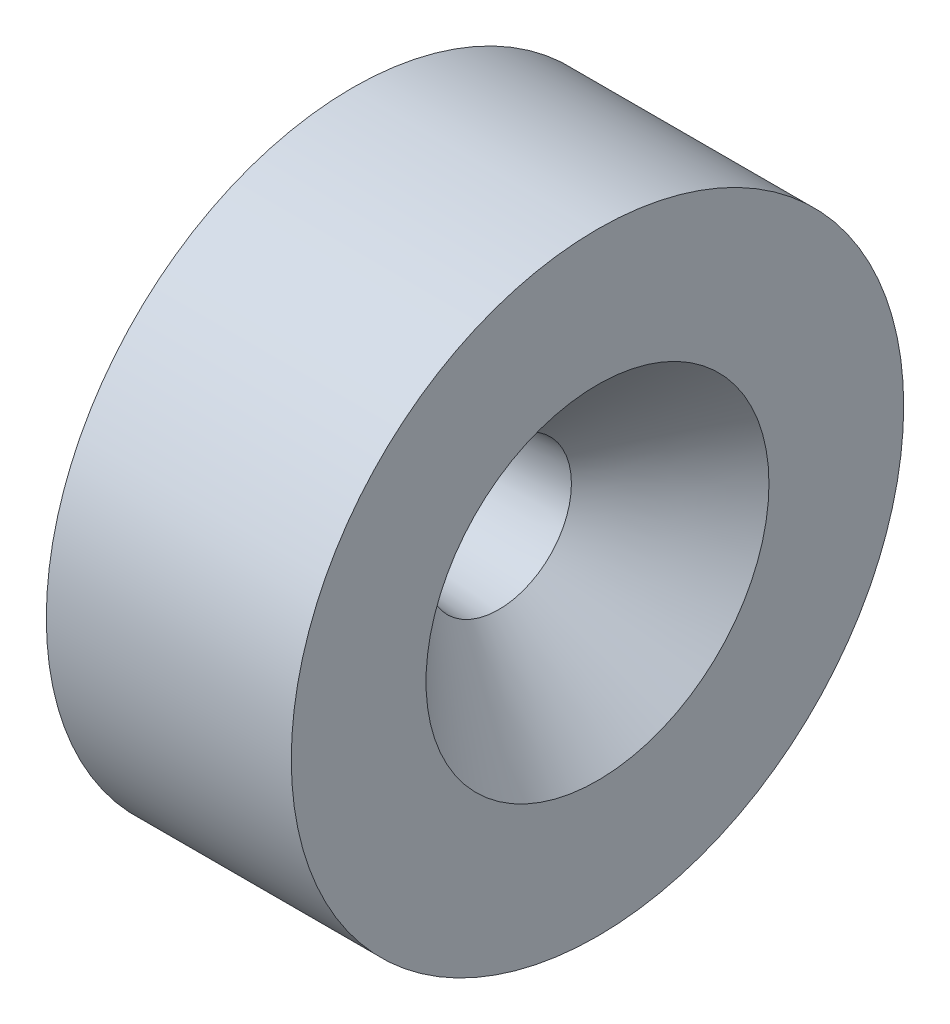
ISO-10303-21;
HEADER;
FILE_DESCRIPTION(('STEP AP214'),'2;1');
FILE_NAME('part.step','',(''),(''),'','','');
FILE_SCHEMA(('AUTOMOTIVE_DESIGN { 1 0 10303 214 1 1 1 1 }'));
ENDSEC;
DATA;
#1=APPLICATION_CONTEXT('core data for automotive mechanical design processes');
#2=APPLICATION_PROTOCOL_DEFINITION('international standard','automotive_design',2000,#1);
#3=PRODUCT_CONTEXT('',#1,'mechanical');
#4=PRODUCT('Part','Part','',(#3));
#5=PRODUCT_RELATED_PRODUCT_CATEGORY('part','',(#4));
#6=PRODUCT_DEFINITION_FORMATION('','',#4);
#7=PRODUCT_DEFINITION_CONTEXT('part definition',#1,'design');
#8=PRODUCT_DEFINITION('design','',#6,#7);
#9=PRODUCT_DEFINITION_SHAPE('','',#8);
#10=(LENGTH_UNIT() NAMED_UNIT(*) SI_UNIT(.MILLI.,.METRE.));
#11=(NAMED_UNIT(*) PLANE_ANGLE_UNIT() SI_UNIT($,.RADIAN.));
#12=(NAMED_UNIT(*) SI_UNIT($,.STERADIAN.) SOLID_ANGLE_UNIT());
#13=UNCERTAINTY_MEASURE_WITH_UNIT(LENGTH_MEASURE(1.E-05),#10,'distance_accuracy_value','');
#14=(GEOMETRIC_REPRESENTATION_CONTEXT(3) GLOBAL_UNCERTAINTY_ASSIGNED_CONTEXT((#13)) GLOBAL_UNIT_ASSIGNED_CONTEXT((#10,
#11,#12)) REPRESENTATION_CONTEXT('',''));
#15=CARTESIAN_POINT('',(0.,0.,0.));
#16=DIRECTION('',(0.,0.,1.));
#17=DIRECTION('',(1.,0.,0.));
#18=AXIS2_PLACEMENT_3D('',#15,#16,#17);
#19=CARTESIAN_POINT('',(4.,-21.699923803499,9.3253624279344));
#20=DIRECTION('',(-1.,0.,0.));
#21=DIRECTION('',(0.,0.,1.));
#22=AXIS2_PLACEMENT_3D('',#19,#20,#21);
#23=CYLINDRICAL_SURFACE('',#22,5.);
#24=CARTESIAN_POINT('',(4.,-21.699923803499,9.3253624279344));
#25=DIRECTION('',(1.,0.,0.));
#26=DIRECTION('',(0.,0.,-1.));
#27=AXIS2_PLACEMENT_3D('',#24,#25,#26);
#28=CIRCLE('',#27,5.);
#29=CARTESIAN_POINT('',(4.,-21.699923803499,4.32536242793439));
#30=VERTEX_POINT('',#29);
#31=EDGE_CURVE('E51',#30,#30,#28,.T.);
#32=ORIENTED_EDGE('',*,*,#31,.F.);
#33=EDGE_LOOP('',(#32));
#34=FACE_BOUND('',#33,.T.);
#35=CARTESIAN_POINT('',(0.,-21.699923803499,9.3253624279344));
#36=DIRECTION('',(1.,0.,0.));
#37=DIRECTION('',(0.,0.,-1.));
#38=AXIS2_PLACEMENT_3D('',#35,#36,#37);
#39=CIRCLE('',#38,5.);
#40=CARTESIAN_POINT('',(0.,-21.699923803499,4.32536242793439));
#41=VERTEX_POINT('',#40);
#42=EDGE_CURVE('E55',#41,#41,#39,.T.);
#43=ORIENTED_EDGE('',*,*,#42,.T.);
#44=EDGE_LOOP('',(#43));
#45=FACE_BOUND('',#44,.T.);
#46=ADVANCED_FACE('F39',(#34,#45),#23,.T.);
#47=CARTESIAN_POINT('',(4.,-21.699923803499,9.3253624279344));
#48=DIRECTION('',(1.,0.,0.));
#49=DIRECTION('',(0.,0.,-1.));
#50=AXIS2_PLACEMENT_3D('',#47,#48,#49);
#51=PLANE('',#50);
#52=CARTESIAN_POINT('',(4.,-21.699923803499,9.3253624279344));
#53=DIRECTION('',(1.,0.,0.));
#54=DIRECTION('',(0.,0.,-1.));
#55=AXIS2_PLACEMENT_3D('',#52,#53,#54);
#56=CIRCLE('',#55,2.8);
#57=CARTESIAN_POINT('',(4.,-21.699923803499,6.5253624279344));
#58=VERTEX_POINT('',#57);
#59=EDGE_CURVE('E10',#58,#58,#56,.F.);
#60=ORIENTED_EDGE('',*,*,#59,.T.);
#61=EDGE_LOOP('',(#60));
#62=FACE_BOUND('',#61,.T.);
#63=ORIENTED_EDGE('',*,*,#31,.T.);
#64=EDGE_LOOP('',(#63));
#65=FACE_BOUND('',#64,.T.);
#66=ADVANCED_FACE('F75',(#62,#65),#51,.T.);
#67=CARTESIAN_POINT('',(0.,-21.699923803499,9.3253624279344));
#68=DIRECTION('',(1.,0.,0.));
#69=DIRECTION('',(0.,0.,-1.));
#70=AXIS2_PLACEMENT_3D('',#67,#68,#69);
#71=PLANE('',#70);
#72=CARTESIAN_POINT('',(0.,-21.699923803499,9.3253624279344));
#73=DIRECTION('',(1.,0.,0.));
#74=DIRECTION('',(0.,0.,-1.));
#75=AXIS2_PLACEMENT_3D('',#72,#73,#74);
#76=CIRCLE('',#75,1.02029275222596);
#77=CARTESIAN_POINT('',(0.,-21.699923803499,8.30506967570844));
#78=VERTEX_POINT('',#77);
#79=EDGE_CURVE('E59',#78,#78,#76,.T.);
#80=ORIENTED_EDGE('',*,*,#79,.T.);
#81=EDGE_LOOP('',(#80));
#82=FACE_BOUND('',#81,.T.);
#83=ORIENTED_EDGE('',*,*,#42,.F.);
#84=EDGE_LOOP('',(#83));
#85=FACE_BOUND('',#84,.T.);
#86=ADVANCED_FACE('F64',(#82,#85),#71,.F.);
#87=CARTESIAN_POINT('',(4.,-21.699923803499,9.3253624279344));
#88=DIRECTION('',(1.,0.,0.));
#89=DIRECTION('',(0.,0.,-1.));
#90=AXIS2_PLACEMENT_3D('',#87,#88,#89);
#91=CONICAL_SURFACE('',#90,1.3,0.0698131700797733);
#92=CARTESIAN_POINT('',(2.38722369458425,-21.699923803499,9.3253624279344));
#93=DIRECTION('',(1.,0.,0.));
#94=DIRECTION('',(0.,0.,-1.));
#95=AXIS2_PLACEMENT_3D('',#92,#93,#94);
#96=CIRCLE('',#95,1.18722369458424);
#97=CARTESIAN_POINT('',(2.38722369458424,-21.699923803499,8.13813873335016));
#98=VERTEX_POINT('',#97);
#99=EDGE_CURVE('E47',#98,#98,#96,.T.);
#100=ORIENTED_EDGE('',*,*,#99,.T.);
#101=EDGE_LOOP('',(#100));
#102=FACE_BOUND('',#101,.T.);
#103=ORIENTED_EDGE('',*,*,#79,.F.);
#104=EDGE_LOOP('',(#103));
#105=FACE_BOUND('',#104,.T.);
#106=ADVANCED_FACE('F67',(#102,#105),#91,.F.);
#107=CARTESIAN_POINT('',(2.38722369458424,-21.699923803499,9.3253624279344));
#108=DIRECTION('',(1.,0.,0.));
#109=DIRECTION('',(0.,0.,-1.));
#110=AXIS2_PLACEMENT_3D('',#107,#108,#109);
#111=CONICAL_SURFACE('',#110,1.18722369458424,0.785398163397449);
#112=CARTESIAN_POINT('',(4.,-21.699923803499,6.5253624279344));
#113=CARTESIAN_POINT('',(3.98320024681859,-21.699923803499,6.54216218111581));
#114=CARTESIAN_POINT('',(3.96640049363717,-21.699923803499,6.55896193429722));
#115=CARTESIAN_POINT('',(3.93280098727434,-21.699923803499,6.59256144066005));
#116=CARTESIAN_POINT('',(3.91600123409293,-21.699923803499,6.60936119384147));
#117=CARTESIAN_POINT('',(3.8824017277301,-21.699923803499,6.6429607002043));
#118=CARTESIAN_POINT('',(3.86560197454869,-21.699923803499,6.65976045338571));
#119=CARTESIAN_POINT('',(3.83200246818586,-21.699923803499,6.69335995974854));
#120=CARTESIAN_POINT('',(3.81520271500444,-21.699923803499,6.71015971292995));
#121=CARTESIAN_POINT('',(3.78160320864162,-21.699923803499,6.74375921929278));
#122=CARTESIAN_POINT('',(3.7648034554602,-21.699923803499,6.76055897247419));
#123=CARTESIAN_POINT('',(3.73120394909737,-21.699923803499,6.79415847883702));
#124=CARTESIAN_POINT('',(3.71440419591596,-21.699923803499,6.81095823201844));
#125=CARTESIAN_POINT('',(3.68080468955313,-21.699923803499,6.84455773838127));
#126=CARTESIAN_POINT('',(3.66400493637172,-21.699923803499,6.86135749156268));
#127=CARTESIAN_POINT('',(3.63040543000889,-21.699923803499,6.89495699792551));
#128=CARTESIAN_POINT('',(3.61360567682747,-21.699923803499,6.91175675110692));
#129=CARTESIAN_POINT('',(3.58000617046465,-21.699923803499,6.94535625746975));
#130=CARTESIAN_POINT('',(3.56320641728323,-21.699923803499,6.96215601065116));
#131=CARTESIAN_POINT('',(3.5296069109204,-21.699923803499,6.99575551701399));
#132=CARTESIAN_POINT('',(3.51280715773899,-21.699923803499,7.01255527019541));
#133=CARTESIAN_POINT('',(3.47920765137616,-21.699923803499,7.04615477655824));
#134=CARTESIAN_POINT('',(3.46240789819475,-21.699923803499,7.06295452973965));
#135=CARTESIAN_POINT('',(3.42880839183192,-21.699923803499,7.09655403610248));
#136=CARTESIAN_POINT('',(3.41200863865051,-21.699923803499,7.11335378928389));
#137=CARTESIAN_POINT('',(3.37840913228768,-21.699923803499,7.14695329564672));
#138=CARTESIAN_POINT('',(3.36160937910626,-21.699923803499,7.16375304882813));
#139=CARTESIAN_POINT('',(3.32800987274344,-21.699923803499,7.19735255519096));
#140=CARTESIAN_POINT('',(3.31121011956202,-21.699923803499,7.21415230837238));
#141=CARTESIAN_POINT('',(3.27761061319919,-21.699923803499,7.2477518147352));
#142=CARTESIAN_POINT('',(3.26081086001778,-21.699923803499,7.26455156791662));
#143=CARTESIAN_POINT('',(3.22721135365495,-21.699923803499,7.29815107427945));
#144=CARTESIAN_POINT('',(3.21041160047354,-21.699923803499,7.31495082746086));
#145=CARTESIAN_POINT('',(3.17681209411071,-21.699923803499,7.34855033382369));
#146=CARTESIAN_POINT('',(3.16001234092929,-21.699923803499,7.3653500870051));
#147=CARTESIAN_POINT('',(3.12641283456647,-21.699923803499,7.39894959336793));
#148=CARTESIAN_POINT('',(3.10961308138505,-21.699923803499,7.41574934654935));
#149=CARTESIAN_POINT('',(3.07601357502222,-21.699923803499,7.44934885291217));
#150=CARTESIAN_POINT('',(3.05921382184081,-21.699923803499,7.46614860609359));
#151=CARTESIAN_POINT('',(3.02561431547798,-21.699923803499,7.49974811245642));
#152=CARTESIAN_POINT('',(3.00881456229657,-21.699923803499,7.51654786563783));
#153=CARTESIAN_POINT('',(2.97521505593374,-21.699923803499,7.55014737200066));
#154=CARTESIAN_POINT('',(2.95841530275232,-21.699923803499,7.56694712518207));
#155=CARTESIAN_POINT('',(2.9248157963895,-21.699923803499,7.6005466315449));
#156=CARTESIAN_POINT('',(2.90801604320808,-21.699923803499,7.61734638472632));
#157=CARTESIAN_POINT('',(2.87441653684525,-21.699923803499,7.65094589108914));
#158=CARTESIAN_POINT('',(2.85761678366384,-21.699923803499,7.66774564427056));
#159=CARTESIAN_POINT('',(2.82401727730101,-21.699923803499,7.70134515063339));
#160=CARTESIAN_POINT('',(2.8072175241196,-21.699923803499,7.7181449038148));
#161=CARTESIAN_POINT('',(2.77361801775677,-21.699923803499,7.75174441017763));
#162=CARTESIAN_POINT('',(2.75681826457536,-21.699923803499,7.76854416335904));
#163=CARTESIAN_POINT('',(2.72321875821253,-21.699923803499,7.80214366972187));
#164=CARTESIAN_POINT('',(2.70641900503111,-21.699923803499,7.81894342290329));
#165=CARTESIAN_POINT('',(2.67281949866828,-21.699923803499,7.85254292926611));
#166=CARTESIAN_POINT('',(2.65601974548687,-21.699923803499,7.86934268244753));
#167=CARTESIAN_POINT('',(2.62242023912404,-21.699923803499,7.90294218881036));
#168=CARTESIAN_POINT('',(2.60562048594263,-21.699923803499,7.91974194199177));
#169=CARTESIAN_POINT('',(2.5720209795798,-21.699923803499,7.9533414483546));
#170=CARTESIAN_POINT('',(2.55522122639839,-21.699923803499,7.97014120153601));
#171=CARTESIAN_POINT('',(2.52162172003556,-21.699923803499,8.00374070789884));
#172=CARTESIAN_POINT('',(2.50482196685414,-21.699923803499,8.02054046108026));
#173=CARTESIAN_POINT('',(2.47122246049132,-21.699923803499,8.05413996744308));
#174=CARTESIAN_POINT('',(2.4544227073099,-21.699923803499,8.0709397206245));
#175=CARTESIAN_POINT('',(2.42082320094707,-21.699923803499,8.10453922698733));
#176=CARTESIAN_POINT('',(2.40402344776566,-21.699923803499,8.12133898016874));
#177=CARTESIAN_POINT('',(2.38722369458424,-21.699923803499,8.13813873335016));
#178=B_SPLINE_CURVE_WITH_KNOTS('',3,(#112,#113,#114,#115,#116,#117,#118,#119,#120,#121,#122,
#123,#124,#125,#126,#127,#128,#129,#130,#131,#132,#133,#134,#135,#136,#137,#138,#139,#140,#141,
#142,#143,#144,#145,#146,#147,#148,#149,#150,#151,#152,#153,#154,#155,#156,#157,#158,#159,#160,
#161,#162,#163,#164,#165,#166,#167,#168,#169,#170,#171,#172,#173,#174,#175,#176,#177),
.UNSPECIFIED.,.F.,.F.,(4,2,2,2,2,2,2,2,2,2,2,2,2,2,2,2,2,2,2,2,2,2,2,2,2,2,2,2,2,2,2,2,4),(0.,
0.0712753163810299,0.142550632762058,0.213825949143088,0.285101265524117,0.356376581905146,
0.427651898286175,0.498927214667205,0.570202531048234,0.641477847429263,0.712753163810292,
0.784028480191321,0.855303796572351,0.92657911295338,0.997854429334409,1.06912974571544,
1.14040506209647,1.2116803784775,1.28295569485853,1.35423101123956,1.42550632762058,
1.49678164400161,1.56805696038264,1.63933227676367,1.7106075931447,1.78188290952573,
1.85315822590676,1.92443354228779,1.99570885866882,2.06698417504985,2.13825949143088,
2.20953480781191,2.28081012419294),.UNSPECIFIED.);
#179=EDGE_CURVE('BSEAM42',#58,#98,#178,.T.);
#180=ORIENTED_EDGE('',*,*,#59,.F.);
#181=ORIENTED_EDGE('',*,*,#99,.F.);
#182=ORIENTED_EDGE('',*,*,#179,.T.);
#183=ORIENTED_EDGE('',*,*,#179,.F.);
#184=EDGE_LOOP('',(#180,#182,#181,#183));
#185=FACE_BOUND('',#184,.T.);
#186=ADVANCED_FACE('F42',(#185),#111,.F.);
#187=CLOSED_SHELL('',(#46,#66,#86,#106,#186));
#188=MANIFOLD_SOLID_BREP('B2',#187);
#189=ADVANCED_BREP_SHAPE_REPRESENTATION('',(#18,#188),#14);
#190=SHAPE_DEFINITION_REPRESENTATION(#9,#189);
ENDSEC;
END-ISO-10303-21;
